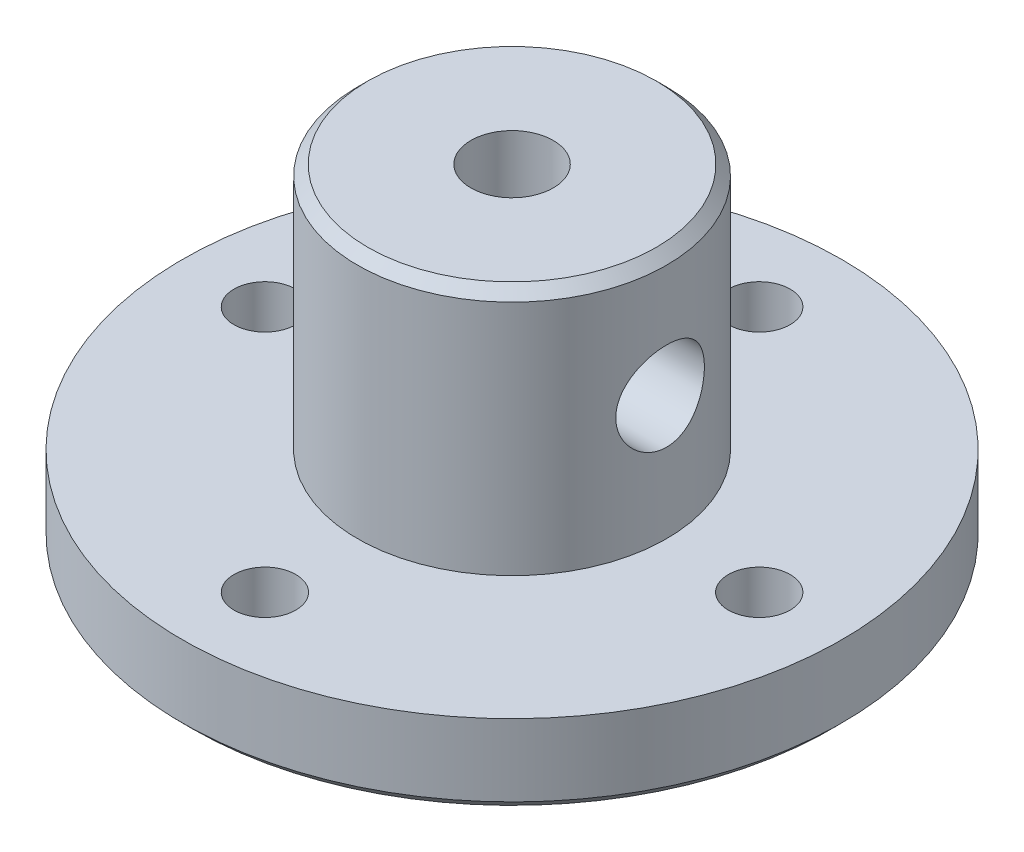
ISO-10303-21;
HEADER;
FILE_DESCRIPTION(('STEP AP214'),'2;1');
FILE_NAME('part.step','',(''),(''),'','','');
FILE_SCHEMA(('AUTOMOTIVE_DESIGN { 1 0 10303 214 1 1 1 1 }'));
ENDSEC;
DATA;
#1=APPLICATION_CONTEXT('core data for automotive mechanical design processes');
#2=APPLICATION_PROTOCOL_DEFINITION('international standard','automotive_design',2000,#1);
#3=PRODUCT_CONTEXT('',#1,'mechanical');
#4=PRODUCT('Part','Part','',(#3));
#5=PRODUCT_RELATED_PRODUCT_CATEGORY('part','',(#4));
#6=PRODUCT_DEFINITION_FORMATION('','',#4);
#7=PRODUCT_DEFINITION_CONTEXT('part definition',#1,'design');
#8=PRODUCT_DEFINITION('design','',#6,#7);
#9=PRODUCT_DEFINITION_SHAPE('','',#8);
#10=(LENGTH_UNIT() NAMED_UNIT(*) SI_UNIT(.MILLI.,.METRE.));
#11=(NAMED_UNIT(*) PLANE_ANGLE_UNIT() SI_UNIT($,.RADIAN.));
#12=(NAMED_UNIT(*) SI_UNIT($,.STERADIAN.) SOLID_ANGLE_UNIT());
#13=UNCERTAINTY_MEASURE_WITH_UNIT(LENGTH_MEASURE(1.E-05),#10,'distance_accuracy_value','');
#14=(GEOMETRIC_REPRESENTATION_CONTEXT(3) GLOBAL_UNCERTAINTY_ASSIGNED_CONTEXT((#13)) GLOBAL_UNIT_ASSIGNED_CONTEXT((#10,
#11,#12)) REPRESENTATION_CONTEXT('',''));
#15=CARTESIAN_POINT('',(0.,0.,0.));
#16=DIRECTION('',(0.,0.,1.));
#17=DIRECTION('',(1.,0.,0.));
#18=AXIS2_PLACEMENT_3D('',#15,#16,#17);
#19=CARTESIAN_POINT('',(0.,22.2286282127256,0.));
#20=DIRECTION('',(0.,1.,0.));
#21=DIRECTION('',(0.,0.,1.));
#22=AXIS2_PLACEMENT_3D('',#19,#20,#21);
#23=PLANE('',#22);
#24=CARTESIAN_POINT('',(0.,22.2286282127256,0.));
#25=DIRECTION('',(0.,1.,0.));
#26=DIRECTION('',(0.,0.,1.));
#27=AXIS2_PLACEMENT_3D('',#24,#25,#26);
#28=CIRCLE('',#27,2.);
#29=CARTESIAN_POINT('',(0.,22.2286282127256,2.));
#30=VERTEX_POINT('',#29);
#31=EDGE_CURVE('E120',#30,#30,#28,.T.);
#32=ORIENTED_EDGE('',*,*,#31,.F.);
#33=EDGE_LOOP('',(#32));
#34=FACE_BOUND('',#33,.T.);
#35=CARTESIAN_POINT('',(0.,22.2286282127256,0.));
#36=DIRECTION('',(0.,-1.,0.));
#37=DIRECTION('',(0.,0.,-1.));
#38=AXIS2_PLACEMENT_3D('',#35,#36,#37);
#39=CIRCLE('',#38,7.);
#40=CARTESIAN_POINT('',(0.,22.2286282127256,-7.));
#41=VERTEX_POINT('',#40);
#42=EDGE_CURVE('E77',#41,#41,#39,.T.);
#43=ORIENTED_EDGE('',*,*,#42,.F.);
#44=EDGE_LOOP('',(#43));
#45=FACE_BOUND('',#44,.T.);
#46=ADVANCED_FACE('F32',(#34,#45),#23,.T.);
#47=CARTESIAN_POINT('',(0.,21.7286282127256,0.));
#48=DIRECTION('',(0.,-1.,0.));
#49=DIRECTION('',(0.,0.,-1.));
#50=AXIS2_PLACEMENT_3D('',#47,#48,#49);
#51=CONICAL_SURFACE('',#50,7.5,0.785398163397448);
#52=ORIENTED_EDGE('',*,*,#42,.T.);
#53=EDGE_LOOP('',(#52));
#54=FACE_BOUND('',#53,.T.);
#55=CARTESIAN_POINT('',(0.,21.7286282127256,0.));
#56=DIRECTION('',(0.,-1.,0.));
#57=DIRECTION('',(0.,0.,-1.));
#58=AXIS2_PLACEMENT_3D('',#55,#56,#57);
#59=CIRCLE('',#58,7.5);
#60=CARTESIAN_POINT('',(0.,21.7286282127256,-7.5));
#61=VERTEX_POINT('',#60);
#62=EDGE_CURVE('E138',#61,#61,#59,.T.);
#63=ORIENTED_EDGE('',*,*,#62,.F.);
#64=EDGE_LOOP('',(#63));
#65=FACE_BOUND('',#64,.T.);
#66=ADVANCED_FACE('F112',(#54,#65),#51,.T.);
#67=CARTESIAN_POINT('',(0.,0.,0.));
#68=DIRECTION('',(0.,-1.,0.));
#69=DIRECTION('',(0.,0.,-1.));
#70=AXIS2_PLACEMENT_3D('',#67,#68,#69);
#71=CYLINDRICAL_SURFACE('',#70,7.5);
#72=CARTESIAN_POINT('',(7.18522790174397,16.2286282127256,-2.15));
#73=CARTESIAN_POINT('',(7.18522952959183,16.3467005145553,-2.14999791278128));
#74=CARTESIAN_POINT('',(7.18817010293663,16.4647938714445,-2.14024056046012));
#75=CARTESIAN_POINT('',(7.19957265736512,16.697545354359,-2.10155838023307));
#76=CARTESIAN_POINT('',(7.20803685767871,16.8122020802737,-2.07262584823439));
#77=CARTESIAN_POINT('',(7.22945098205107,17.0346784327167,-1.99664250384145));
#78=CARTESIAN_POINT('',(7.24239392359912,17.142508394651,-1.949619881837));
#79=CARTESIAN_POINT('',(7.27129797147,17.348771734525,-1.83888214063124));
#80=CARTESIAN_POINT('',(7.28725944230478,17.4472039754508,-1.7751650050731));
#81=CARTESIAN_POINT('',(7.32091920300458,17.634721888412,-1.63087662814557));
#82=CARTESIAN_POINT('',(7.33865199705826,17.7234958184652,-1.54990820537289));
#83=CARTESIAN_POINT('',(7.37356037832633,17.8864091729335,-1.3742680923439));
#84=CARTESIAN_POINT('',(7.39073589969187,17.9605468731164,-1.27959478984826));
#85=CARTESIAN_POINT('',(7.4229836183,18.0934146868685,-1.07703777176159));
#86=CARTESIAN_POINT('',(7.43801039636039,18.1518302176313,-0.968939842931909));
#87=CARTESIAN_POINT('',(7.46386870327287,18.2495358274319,-0.743952246951203));
#88=CARTESIAN_POINT('',(7.47470105453357,18.2888296560836,-0.627064308645577));
#89=CARTESIAN_POINT('',(7.49070592792324,18.3461542012923,-0.391073184646221));
#90=CARTESIAN_POINT('',(7.49601963551321,18.3647162969986,-0.272108822107239));
#91=CARTESIAN_POINT('',(7.50088424095956,18.3817272167193,-0.0326437400395143));
#92=CARTESIAN_POINT('',(7.50043624748667,18.3801799101991,0.0878566794621086));
#93=CARTESIAN_POINT('',(7.49392923934446,18.3573798824655,0.323257585634359));
#94=CARTESIAN_POINT('',(7.48803392143217,18.3367020278833,0.438218980190829));
#95=CARTESIAN_POINT('',(7.47149120712331,18.2771626386443,0.662965804759459));
#96=CARTESIAN_POINT('',(7.46084352074875,18.2382999943888,0.772750918475513));
#97=CARTESIAN_POINT('',(7.43575936625189,18.1430840590023,0.985436796483991));
#98=CARTESIAN_POINT('',(7.4212825716075,18.0865433619294,1.08824871033498));
#99=CARTESIAN_POINT('',(7.39008595087552,17.9577226123679,1.28311429421692));
#100=CARTESIAN_POINT('',(7.3733656308569,17.885439091774,1.37516558683195));
#101=CARTESIAN_POINT('',(7.33878384837899,17.7241734212188,1.54932888111556));
#102=CARTESIAN_POINT('',(7.32090293943718,17.6346916410914,1.63097498084543));
#103=CARTESIAN_POINT('',(7.28653845296415,17.4431265615679,1.77822668112071));
#104=CARTESIAN_POINT('',(7.27005499045911,17.3410422265298,1.84383096207286));
#105=CARTESIAN_POINT('',(7.24026455697807,17.1260335345306,1.95756708499716));
#106=CARTESIAN_POINT('',(7.22698434166858,17.0130282189594,2.00555339409292));
#107=CARTESIAN_POINT('',(7.20542660143551,16.7800746035367,2.08168459866565));
#108=CARTESIAN_POINT('',(7.19714760965565,16.6601283507797,2.10983531231608));
#109=CARTESIAN_POINT('',(7.18684781252248,16.421100549415,2.144653602803));
#110=CARTESIAN_POINT('',(7.18462237338161,16.3021300925999,2.15202396372803));
#111=CARTESIAN_POINT('',(7.18611823027872,16.064652586033,2.14702412882125));
#112=CARTESIAN_POINT('',(7.18983877872691,15.9461454799021,2.13465641466047));
#113=CARTESIAN_POINT('',(7.20260783338868,15.71579606501,2.09115491957001));
#114=CARTESIAN_POINT('',(7.21153131160875,15.6038630431827,2.06046111775361));
#115=CARTESIAN_POINT('',(7.23357427541516,15.3867388871854,1.98168244643606));
#116=CARTESIAN_POINT('',(7.24669436927843,15.2815487330128,1.93359505569518));
#117=CARTESIAN_POINT('',(7.27605859677421,15.078004057855,1.82002289524481));
#118=CARTESIAN_POINT('',(7.29237234029344,14.9798847475521,1.75413501332713));
#119=CARTESIAN_POINT('',(7.32613045636106,14.7958377845068,1.60731943096464));
#120=CARTESIAN_POINT('',(7.3435750750828,14.7099127993435,1.52638844867063));
#121=CARTESIAN_POINT('',(7.37834784915199,14.5496847619699,1.34850172783648));
#122=CARTESIAN_POINT('',(7.39565184277786,14.4758766671238,1.25109441330888));
#123=CARTESIAN_POINT('',(7.42759125711435,14.3456492959685,1.04487248660158));
#124=CARTESIAN_POINT('',(7.44222681696933,14.289229112868,0.936058469685887));
#125=CARTESIAN_POINT('',(7.46708736991064,14.195918363346,0.710863340900806));
#126=CARTESIAN_POINT('',(7.47734562094681,14.1588800313142,0.594547310376428));
#127=CARTESIAN_POINT('',(7.49244262682451,14.1049815670571,0.356998709934216));
#128=CARTESIAN_POINT('',(7.49728278590225,14.0881162064159,0.235767422374526));
#129=CARTESIAN_POINT('',(7.50092061581289,14.0754115811521,-0.00357653114589186));
#130=CARTESIAN_POINT('',(7.49992549360983,14.0788513254198,-0.121648278122092));
#131=CARTESIAN_POINT('',(7.49248478243479,14.1049561550966,-0.355461892768324));
#132=CARTESIAN_POINT('',(7.48603945751709,14.1276203091115,-0.471203873033988));
#133=CARTESIAN_POINT('',(7.4684744994608,14.1910991859595,-0.696063497776017));
#134=CARTESIAN_POINT('',(7.45739770907534,14.2317477419496,-0.805231624632801));
#135=CARTESIAN_POINT('',(7.43171965904609,14.3298937131835,-1.01525842059505));
#136=CARTESIAN_POINT('',(7.41711785143841,14.3873937482871,-1.11611579452127));
#137=CARTESIAN_POINT('',(7.3853922498125,14.5196079917492,-1.30993111605423));
#138=CARTESIAN_POINT('',(7.36820611983216,14.594785354002,-1.40256284919886));
#139=CARTESIAN_POINT('',(7.33346889204965,14.7593680843565,-1.57413865649494));
#140=CARTESIAN_POINT('',(7.31591769431319,14.8487773941094,-1.6530789259928));
#141=CARTESIAN_POINT('',(7.28189482862385,15.0421322372322,-1.79712019136953));
#142=CARTESIAN_POINT('',(7.26546408239614,15.1464001385138,-1.86179911062207));
#143=CARTESIAN_POINT('',(7.23616291956501,15.3647869937987,-1.97262579069247));
#144=CARTESIAN_POINT('',(7.22329052950073,15.4789004412063,-2.01878382961241));
#145=CARTESIAN_POINT('',(7.20405285638923,15.6983291444646,-2.08630908304128));
#146=CARTESIAN_POINT('',(7.19705610112881,15.8028390375437,-2.11013155173257));
#147=CARTESIAN_POINT('',(7.18764325279373,16.014436527077,-2.14197668995079));
#148=CARTESIAN_POINT('',(7.18522642510773,16.1215237073484,-2.15000189333591));
#149=CARTESIAN_POINT('',(7.18522790174397,16.2286282127256,-2.15));
#150=B_SPLINE_CURVE_WITH_KNOTS('',3,(#72,#73,#74,#75,#76,#77,#78,#79,#80,#81,#82,#83,#84,#85,
#86,#87,#88,#89,#90,#91,#92,#93,#94,#95,#96,#97,#98,#99,#100,#101,#102,#103,#104,#105,#106,#107,
#108,#109,#110,#111,#112,#113,#114,#115,#116,#117,#118,#119,#120,#121,#122,#123,#124,#125,#126,
#127,#128,#129,#130,#131,#132,#133,#134,#135,#136,#137,#138,#139,#140,#141,#142,#143,#144,#145,
#146,#147,#148,#149),.UNSPECIFIED.,.T.,.F.,(4,2,2,2,2,2,2,2,2,2,2,2,2,2,2,2,2,2,2,2,2,2,2,2,2,2,
2,2,2,2,2,2,2,2,2,2,2,2,4),(0.,0.353822347415786,0.707786937775859,1.06120215314891,
1.41466007356586,1.77736138251889,2.14010539430869,2.50964340689844,2.87910892678965,
3.23887023530609,3.59856231932507,3.94778502354856,4.29702903940711,4.65010867684082,
5.00326617566948,5.36889745454903,5.7345587999933,6.10317611960638,6.47168527139026,
6.82757281136743,7.183415609078,7.53104058316896,7.87871596648591,8.2350422596189,
8.59144638143129,8.95997808557066,9.32849056727929,9.69415103151202,10.0597167035859,
10.4123818573577,10.7650299260027,11.1144856187066,11.4639956693137,11.8239524100005,
12.1840090175921,12.5536051289085,12.9229958494518,13.2440029514767,13.5649585602361),.UNSPECIFIED.);
#151=CARTESIAN_POINT('',(7.18522790174397,16.2286282127256,-2.15));
#152=VERTEX_POINT('',#151);
#153=EDGE_CURVE('E70',#152,#152,#150,.T.);
#154=ORIENTED_EDGE('',*,*,#153,.F.);
#155=EDGE_LOOP('',(#154));
#156=FACE_BOUND('',#155,.T.);
#157=ORIENTED_EDGE('',*,*,#62,.T.);
#158=EDGE_LOOP('',(#157));
#159=FACE_BOUND('',#158,.T.);
#160=CARTESIAN_POINT('',(0.,10.2286282127256,0.));
#161=DIRECTION('',(0.,-1.,0.));
#162=DIRECTION('',(0.,0.,-1.));
#163=AXIS2_PLACEMENT_3D('',#160,#161,#162);
#164=CIRCLE('',#163,7.5);
#165=CARTESIAN_POINT('',(0.,10.2286282127256,-7.5));
#166=VERTEX_POINT('',#165);
#167=EDGE_CURVE('E136',#166,#166,#164,.T.);
#168=ORIENTED_EDGE('',*,*,#167,.F.);
#169=EDGE_LOOP('',(#168));
#170=FACE_BOUND('',#169,.T.);
#171=ADVANCED_FACE('F107',(#156,#159,#170),#71,.T.);
#172=CARTESIAN_POINT('',(7.5,10.2286282127256,0.));
#173=DIRECTION('',(0.,1.,0.));
#174=DIRECTION('',(0.,0.,1.));
#175=AXIS2_PLACEMENT_3D('',#172,#173,#174);
#176=PLANE('',#175);
#177=CARTESIAN_POINT('',(0.,10.2286282127256,-12.));
#178=DIRECTION('',(0.,1.,0.));
#179=DIRECTION('',(0.,0.,1.));
#180=AXIS2_PLACEMENT_3D('',#177,#178,#179);
#181=CIRCLE('',#180,1.5);
#182=CARTESIAN_POINT('',(0.,10.2286282127256,-10.5));
#183=VERTEX_POINT('',#182);
#184=EDGE_CURVE('E269',#183,#183,#181,.T.);
#185=ORIENTED_EDGE('',*,*,#184,.F.);
#186=EDGE_LOOP('',(#185));
#187=FACE_BOUND('',#186,.T.);
#188=CARTESIAN_POINT('',(12.,10.2286282127256,0.));
#189=DIRECTION('',(0.,1.,0.));
#190=DIRECTION('',(0.,0.,1.));
#191=AXIS2_PLACEMENT_3D('',#188,#189,#190);
#192=CIRCLE('',#191,1.5);
#193=CARTESIAN_POINT('',(12.,10.2286282127256,1.5));
#194=VERTEX_POINT('',#193);
#195=EDGE_CURVE('E270',#194,#194,#192,.T.);
#196=ORIENTED_EDGE('',*,*,#195,.F.);
#197=EDGE_LOOP('',(#196));
#198=FACE_BOUND('',#197,.T.);
#199=CARTESIAN_POINT('',(0.,10.2286282127256,12.));
#200=DIRECTION('',(0.,1.,0.));
#201=DIRECTION('',(0.,0.,1.));
#202=AXIS2_PLACEMENT_3D('',#199,#200,#201);
#203=CIRCLE('',#202,1.5);
#204=CARTESIAN_POINT('',(0.,10.2286282127256,13.5));
#205=VERTEX_POINT('',#204);
#206=EDGE_CURVE('E279',#205,#205,#203,.T.);
#207=ORIENTED_EDGE('',*,*,#206,.F.);
#208=EDGE_LOOP('',(#207));
#209=FACE_BOUND('',#208,.T.);
#210=CARTESIAN_POINT('',(-12.,10.2286282127256,0.));
#211=DIRECTION('',(0.,1.,0.));
#212=DIRECTION('',(0.,0.,1.));
#213=AXIS2_PLACEMENT_3D('',#210,#211,#212);
#214=CIRCLE('',#213,1.5);
#215=CARTESIAN_POINT('',(-12.,10.2286282127256,1.5));
#216=VERTEX_POINT('',#215);
#217=EDGE_CURVE('E285',#216,#216,#214,.T.);
#218=ORIENTED_EDGE('',*,*,#217,.F.);
#219=EDGE_LOOP('',(#218));
#220=FACE_BOUND('',#219,.T.);
#221=ORIENTED_EDGE('',*,*,#167,.T.);
#222=EDGE_LOOP('',(#221));
#223=FACE_BOUND('',#222,.T.);
#224=CARTESIAN_POINT('',(0.,10.2286282127256,0.));
#225=DIRECTION('',(0.,-1.,0.));
#226=DIRECTION('',(0.,0.,-1.));
#227=AXIS2_PLACEMENT_3D('',#224,#225,#226);
#228=CIRCLE('',#227,16.);
#229=CARTESIAN_POINT('',(0.,10.2286282127256,-16.));
#230=VERTEX_POINT('',#229);
#231=EDGE_CURVE('E133',#230,#230,#228,.T.);
#232=ORIENTED_EDGE('',*,*,#231,.F.);
#233=EDGE_LOOP('',(#232));
#234=FACE_BOUND('',#233,.T.);
#235=ADVANCED_FACE('F103',(#187,#198,#209,#220,#223,#234),#176,.T.);
#236=CARTESIAN_POINT('',(0.,0.,0.));
#237=DIRECTION('',(0.,-1.,0.));
#238=DIRECTION('',(0.,0.,-1.));
#239=AXIS2_PLACEMENT_3D('',#236,#237,#238);
#240=CYLINDRICAL_SURFACE('',#239,16.);
#241=ORIENTED_EDGE('',*,*,#231,.T.);
#242=EDGE_LOOP('',(#241));
#243=FACE_BOUND('',#242,.T.);
#244=CARTESIAN_POINT('',(0.,6.72862821272563,0.));
#245=DIRECTION('',(0.,-1.,0.));
#246=DIRECTION('',(0.,0.,-1.));
#247=AXIS2_PLACEMENT_3D('',#244,#245,#246);
#248=CIRCLE('',#247,16.);
#249=CARTESIAN_POINT('',(0.,6.72862821272563,-16.));
#250=VERTEX_POINT('',#249);
#251=EDGE_CURVE('E130',#250,#250,#248,.T.);
#252=ORIENTED_EDGE('',*,*,#251,.F.);
#253=EDGE_LOOP('',(#252));
#254=FACE_BOUND('',#253,.T.);
#255=ADVANCED_FACE('F99',(#243,#254),#240,.T.);
#256=CARTESIAN_POINT('',(0.,6.22862821272563,0.));
#257=DIRECTION('',(0.,1.,0.));
#258=DIRECTION('',(0.,0.,1.));
#259=AXIS2_PLACEMENT_3D('',#256,#257,#258);
#260=CONICAL_SURFACE('',#259,15.5,0.785398163397445);
#261=ORIENTED_EDGE('',*,*,#251,.T.);
#262=EDGE_LOOP('',(#261));
#263=FACE_BOUND('',#262,.T.);
#264=CARTESIAN_POINT('',(0.,6.22862821272563,0.));
#265=DIRECTION('',(0.,-1.,0.));
#266=DIRECTION('',(0.,0.,-1.));
#267=AXIS2_PLACEMENT_3D('',#264,#265,#266);
#268=CIRCLE('',#267,15.5);
#269=CARTESIAN_POINT('',(0.,6.22862821272563,-15.5));
#270=VERTEX_POINT('',#269);
#271=EDGE_CURVE('E125',#270,#270,#268,.T.);
#272=ORIENTED_EDGE('',*,*,#271,.F.);
#273=EDGE_LOOP('',(#272));
#274=FACE_BOUND('',#273,.T.);
#275=ADVANCED_FACE('F95',(#263,#274),#260,.T.);
#276=CARTESIAN_POINT('',(15.5,6.22862821272563,0.));
#277=DIRECTION('',(0.,-1.,0.));
#278=DIRECTION('',(0.,0.,-1.));
#279=AXIS2_PLACEMENT_3D('',#276,#277,#278);
#280=PLANE('',#279);
#281=CARTESIAN_POINT('',(0.,6.22862821272563,-12.));
#282=DIRECTION('',(0.,1.,0.));
#283=DIRECTION('',(0.,0.,1.));
#284=AXIS2_PLACEMENT_3D('',#281,#282,#283);
#285=CIRCLE('',#284,1.5);
#286=CARTESIAN_POINT('',(0.,6.22862821272563,-10.5));
#287=VERTEX_POINT('',#286);
#288=EDGE_CURVE('E266',#287,#287,#285,.T.);
#289=ORIENTED_EDGE('',*,*,#288,.T.);
#290=EDGE_LOOP('',(#289));
#291=FACE_BOUND('',#290,.T.);
#292=CARTESIAN_POINT('',(12.,6.22862821272563,0.));
#293=DIRECTION('',(0.,1.,0.));
#294=DIRECTION('',(0.,0.,1.));
#295=AXIS2_PLACEMENT_3D('',#292,#293,#294);
#296=CIRCLE('',#295,1.5);
#297=CARTESIAN_POINT('',(12.,6.22862821272563,1.5));
#298=VERTEX_POINT('',#297);
#299=EDGE_CURVE('E274',#298,#298,#296,.T.);
#300=ORIENTED_EDGE('',*,*,#299,.T.);
#301=EDGE_LOOP('',(#300));
#302=FACE_BOUND('',#301,.T.);
#303=CARTESIAN_POINT('',(0.,6.22862821272563,12.));
#304=DIRECTION('',(0.,1.,0.));
#305=DIRECTION('',(0.,0.,1.));
#306=AXIS2_PLACEMENT_3D('',#303,#304,#305);
#307=CIRCLE('',#306,1.5);
#308=CARTESIAN_POINT('',(0.,6.22862821272563,13.5));
#309=VERTEX_POINT('',#308);
#310=EDGE_CURVE('E282',#309,#309,#307,.T.);
#311=ORIENTED_EDGE('',*,*,#310,.T.);
#312=EDGE_LOOP('',(#311));
#313=FACE_BOUND('',#312,.T.);
#314=CARTESIAN_POINT('',(-12.,6.22862821272563,0.));
#315=DIRECTION('',(0.,1.,0.));
#316=DIRECTION('',(0.,0.,1.));
#317=AXIS2_PLACEMENT_3D('',#314,#315,#316);
#318=CIRCLE('',#317,1.5);
#319=CARTESIAN_POINT('',(-12.,6.22862821272563,1.5));
#320=VERTEX_POINT('',#319);
#321=EDGE_CURVE('E287',#320,#320,#318,.T.);
#322=ORIENTED_EDGE('',*,*,#321,.T.);
#323=EDGE_LOOP('',(#322));
#324=FACE_BOUND('',#323,.T.);
#325=CARTESIAN_POINT('',(0.,6.22862821272563,0.));
#326=DIRECTION('',(0.,1.,0.));
#327=DIRECTION('',(0.,0.,1.));
#328=AXIS2_PLACEMENT_3D('',#325,#326,#327);
#329=CIRCLE('',#328,2.);
#330=CARTESIAN_POINT('',(0.,6.22862821272563,2.));
#331=VERTEX_POINT('',#330);
#332=EDGE_CURVE('E122',#331,#331,#329,.T.);
#333=ORIENTED_EDGE('',*,*,#332,.T.);
#334=EDGE_LOOP('',(#333));
#335=FACE_BOUND('',#334,.T.);
#336=ORIENTED_EDGE('',*,*,#271,.T.);
#337=EDGE_LOOP('',(#336));
#338=FACE_BOUND('',#337,.T.);
#339=ADVANCED_FACE('F89',(#291,#302,#313,#324,#335,#338),#280,.T.);
#340=CARTESIAN_POINT('',(0.,6.22862821272563,0.));
#341=DIRECTION('',(0.,1.,0.));
#342=DIRECTION('',(0.,0.,1.));
#343=AXIS2_PLACEMENT_3D('',#340,#341,#342);
#344=CYLINDRICAL_SURFACE('',#343,2.);
#345=DIRECTION('',(0.,1.,0.));
#346=VECTOR('',#345,1.);
#347=CARTESIAN_POINT('',(0.,6.22862821272563,-2.));
#348=LINE('',#347,#346);
#349=CARTESIAN_POINT('',(0.,15.4396415208227,-2.));
#350=VERTEX_POINT('',#349);
#351=CARTESIAN_POINT('',(-1.8474805019153E-13,17.0176149046286,-2.));
#352=VERTEX_POINT('',#351);
#353=EDGE_CURVE('E67',#350,#352,#348,.T.);
#354=ORIENTED_EDGE('',*,*,#353,.T.);
#355=CARTESIAN_POINT('',(0.,17.0176149046286,-2.));
#356=CARTESIAN_POINT('',(0.0273844085615572,17.0175855398589,-2.00000587733176));
#357=CARTESIAN_POINT('',(0.0547384046705307,17.0190419370307,-1.99943741063917));
#358=CARTESIAN_POINT('',(0.109030152004812,17.024663370716,-1.99720867164096));
#359=CARTESIAN_POINT('',(0.135969013501376,17.0288190473911,-1.99555217190311));
#360=CARTESIAN_POINT('',(0.214802598947177,17.0447347236194,-1.98912014653098));
#361=CARTESIAN_POINT('',(0.265876504731533,17.0599656665418,-1.98287688028839));
#362=CARTESIAN_POINT('',(0.392329738173156,17.1068332040088,-1.9626980097307));
#363=CARTESIAN_POINT('',(0.46558699923007,17.1428850842001,-1.9464191795755));
#364=CARTESIAN_POINT('',(0.606997055537668,17.2223642043662,-1.90709405910283));
#365=CARTESIAN_POINT('',(0.675069964722995,17.2658822825156,-1.88396150646294));
#366=CARTESIAN_POINT('',(0.80359836837634,17.3538849205391,-1.83269720736004));
#367=CARTESIAN_POINT('',(0.864260134546186,17.3982332563457,-1.80484391561301));
#368=CARTESIAN_POINT('',(0.982073172141564,17.4877978988342,-1.74354350990303));
#369=CARTESIAN_POINT('',(1.0392218027384,17.5330148257228,-1.71009225658259));
#370=CARTESIAN_POINT('',(1.1499387123574,17.6228382156089,-1.63767959149405));
#371=CARTESIAN_POINT('',(1.20352100806636,17.6674464439836,-1.59874188877364));
#372=CARTESIAN_POINT('',(1.30723488550179,17.7552602269681,-1.51511501940283));
#373=CARTESIAN_POINT('',(1.3573663589849,17.7984657375559,-1.47042567246431));
#374=CARTESIAN_POINT('',(1.47697201214311,17.9027607786942,-1.35226556119355));
#375=CARTESIAN_POINT('',(1.54420822680304,17.9625028968569,-1.27526250952679));
#376=CARTESIAN_POINT('',(1.66823788789278,18.0738330212723,-1.10805241683449));
#377=CARTESIAN_POINT('',(1.72504434612519,18.1254311762101,-1.01786208378097));
#378=CARTESIAN_POINT('',(1.81490195874911,18.2075446872069,-0.84473872514298));
#379=CARTESIAN_POINT('',(1.85043595901697,18.240213527611,-0.764129248519861));
#380=CARTESIAN_POINT('',(1.91120482420609,18.2962513238306,-0.596039359248764));
#381=CARTESIAN_POINT('',(1.93644659537525,18.3196265155676,-0.508563601140154));
#382=CARTESIAN_POINT('',(1.97506667104316,18.355441667934,-0.328134814443503));
#383=CARTESIAN_POINT('',(1.98836031287726,18.3678035848163,-0.235147598552556));
#384=CARTESIAN_POINT('',(2.00164670054222,18.3801586063533,-0.047419293288829));
#385=CARTESIAN_POINT('',(2.00164611087527,18.3801579084835,0.0473208934849099));
#386=CARTESIAN_POINT('',(1.98913085859644,18.3685202487054,0.224354937124833));
#387=CARTESIAN_POINT('',(1.97803190263255,18.3581996895688,0.306844337690087));
#388=CARTESIAN_POINT('',(1.94615433976505,18.3286238136334,0.468244261017134));
#389=CARTESIAN_POINT('',(1.92537445571409,18.3093673179707,0.547154310068622));
#390=CARTESIAN_POINT('',(1.87439516725991,18.2622844487737,0.7025495458114));
#391=CARTESIAN_POINT('',(1.8438817817526,18.2341728759257,0.778843313917316));
#392=CARTESIAN_POINT('',(1.7751574646235,18.1711774020659,0.924845315763141));
#393=CARTESIAN_POINT('',(1.73694205173297,18.136289558849,0.99454968074628));
#394=CARTESIAN_POINT('',(1.63242572645347,18.0415240694925,1.16161206603883));
#395=CARTESIAN_POINT('',(1.5618958841303,17.9781261362669,1.25434106183625));
#396=CARTESIAN_POINT('',(1.40953273713361,17.8435601151541,1.42345881301736));
#397=CARTESIAN_POINT('',(1.32767429094505,17.772374820554,1.49981023307227));
#398=CARTESIAN_POINT('',(1.15255045404488,17.6245260469244,1.63842071932248));
#399=CARTESIAN_POINT('',(1.05905733639507,17.5477717890931,1.70029494697712));
#400=CARTESIAN_POINT('',(0.911468627676958,17.4337543267897,1.78111206651714));
#401=CARTESIAN_POINT('',(0.861012196332747,17.3959098104853,1.80606443780502));
#402=CARTESIAN_POINT('',(0.757311924351813,17.3216503509931,1.8519441780583));
#403=CARTESIAN_POINT('',(0.704069970612554,17.2852344685816,1.87287422793703));
#404=CARTESIAN_POINT('',(0.596956389819486,17.2171784900534,1.9096300774691));
#405=CARTESIAN_POINT('',(0.543250672936867,17.1853903948473,1.92565943058698));
#406=CARTESIAN_POINT('',(0.432449371141941,17.1271262841066,1.95351697313848));
#407=CARTESIAN_POINT('',(0.375384219634862,17.1006099451619,1.96537763203531));
#408=CARTESIAN_POINT('',(0.266428681707984,17.0601234887711,1.98280888148682));
#409=CARTESIAN_POINT('',(0.215181677702148,17.0448215710112,1.98908423290061));
#410=CARTESIAN_POINT('',(0.136136393534274,17.0288476126682,1.99554104328926));
#411=CARTESIAN_POINT('',(0.109163557646847,17.0246810743341,1.99720177385445));
#412=CARTESIAN_POINT('',(0.0548050839656649,17.0190448994359,1.99943610471867));
#413=CARTESIAN_POINT('',(0.0274183617444752,17.0175843941835,2.00000602436849));
#414=CARTESIAN_POINT('',(-1.82643841265948E-13,17.0176149046291,2.00000000000004));
#415=B_SPLINE_CURVE_WITH_KNOTS('',3,(#355,#356,#357,#358,#359,#360,#361,#362,#363,#364,#365,
#366,#367,#368,#369,#370,#371,#372,#373,#374,#375,#376,#377,#378,#379,#380,#381,#382,#383,#384,
#385,#386,#387,#388,#389,#390,#391,#392,#393,#394,#395,#396,#397,#398,#399,#400,#401,#402,#403,
#404,#405,#406,#407,#408,#409,#410,#411,#412,#413,#414),.UNSPECIFIED.,.F.,.F.,(4,2,2,2,2,2,2,2,
2,2,2,2,2,2,2,2,2,2,2,2,2,2,2,2,2,2,2,2,2,4),(0.,0.0820581237829252,0.163833216520261,
0.323964234906139,0.572368815528667,0.82404325493108,1.0641567992981,1.30444868419848,
1.54373232650217,1.78302347109739,2.13694263082484,2.49041720769092,2.77117970098653,
3.05175348695236,3.3343000516077,3.61670497346433,3.86716183206017,4.11765174130247,
4.37721651461086,4.6369327486916,5.03262804888716,5.42921603293058,5.83538113340892,
6.03872945009757,6.24194175964696,6.43494843447416,6.6264166314791,6.78709715563077,
6.8689787776908,6.95113620360117),.UNSPECIFIED.);
#416=CARTESIAN_POINT('',(0.,17.0176149046286,2.));
#417=VERTEX_POINT('',#416);
#418=EDGE_CURVE('E11',#352,#417,#415,.T.);
#419=ORIENTED_EDGE('',*,*,#418,.T.);
#420=DIRECTION('',(0.,1.,0.));
#421=VECTOR('',#420,1.);
#422=CARTESIAN_POINT('',(0.,6.22862821272563,2.));
#423=LINE('',#422,#421);
#424=CARTESIAN_POINT('',(-1.8474805019153E-13,15.4396415208227,2.));
#425=VERTEX_POINT('',#424);
#426=EDGE_CURVE('E45',#417,#425,#423,.F.);
#427=ORIENTED_EDGE('',*,*,#426,.T.);
#428=CARTESIAN_POINT('',(0.,15.4396415208227,2.));
#429=CARTESIAN_POINT('',(0.0273844085615571,15.4396708855923,2.00000587733176));
#430=CARTESIAN_POINT('',(0.0547384046705305,15.4382144884206,1.99943741063917));
#431=CARTESIAN_POINT('',(0.109030152004812,15.4325930547352,1.99720867164096));
#432=CARTESIAN_POINT('',(0.135969013501376,15.4284373780601,1.99555217190311));
#433=CARTESIAN_POINT('',(0.214802598947177,15.4125217018319,1.98912014653098));
#434=CARTESIAN_POINT('',(0.265876504731533,15.3972907589094,1.98287688028839));
#435=CARTESIAN_POINT('',(0.392329738173156,15.3504232214424,1.9626980097307));
#436=CARTESIAN_POINT('',(0.46558699923007,15.3143713412512,1.9464191795755));
#437=CARTESIAN_POINT('',(0.606997055537667,15.2348922210851,1.90709405910283));
#438=CARTESIAN_POINT('',(0.675069964722994,15.1913741429357,1.88396150646294));
#439=CARTESIAN_POINT('',(0.80359836837634,15.1033715049122,1.83269720736004));
#440=CARTESIAN_POINT('',(0.864260134546186,15.0590231691055,1.80484391561301));
#441=CARTESIAN_POINT('',(0.982073172141563,14.969458526617,1.74354350990304));
#442=CARTESIAN_POINT('',(1.0392218027384,14.9242415997285,1.71009225658259));
#443=CARTESIAN_POINT('',(1.1499387123574,14.8344182098424,1.63767959149406));
#444=CARTESIAN_POINT('',(1.20352100806636,14.7898099814677,1.59874188877364));
#445=CARTESIAN_POINT('',(1.30723488550179,14.7019961984832,1.51511501940283));
#446=CARTESIAN_POINT('',(1.3573663589849,14.6587906878954,1.47042567246431));
#447=CARTESIAN_POINT('',(1.47697201214311,14.554495646757,1.35226556119355));
#448=CARTESIAN_POINT('',(1.54420822680304,14.4947535285944,1.27526250952679));
#449=CARTESIAN_POINT('',(1.66823788789278,14.383423404179,1.10805241683449));
#450=CARTESIAN_POINT('',(1.72504434612519,14.3318252492412,1.01786208378097));
#451=CARTESIAN_POINT('',(1.81490195874911,14.2497117382443,0.844738725142979));
#452=CARTESIAN_POINT('',(1.85043595901697,14.2170428978403,0.76412924851986));
#453=CARTESIAN_POINT('',(1.91120482420609,14.1610051016207,0.596039359248765));
#454=CARTESIAN_POINT('',(1.93644659537525,14.1376299098836,0.508563601140154));
#455=CARTESIAN_POINT('',(1.97506667104316,14.1018147575173,0.328134814443503));
#456=CARTESIAN_POINT('',(1.98836031287726,14.089452840635,0.235147598552557));
#457=CARTESIAN_POINT('',(2.00164670054222,14.0770978190979,0.04741929328883));
#458=CARTESIAN_POINT('',(2.00164611087526,14.0770985169677,-0.0473208934849089));
#459=CARTESIAN_POINT('',(1.98913085859644,14.0887361767458,-0.224354937124832));
#460=CARTESIAN_POINT('',(1.97803190263255,14.0990567358824,-0.306844337690085));
#461=CARTESIAN_POINT('',(1.94615433976505,14.1286326118179,-0.468244261017133));
#462=CARTESIAN_POINT('',(1.92537445571409,14.1478891074805,-0.547154310068621));
#463=CARTESIAN_POINT('',(1.87439516725991,14.1949719766776,-0.702549545811398));
#464=CARTESIAN_POINT('',(1.8438817817526,14.2230835495255,-0.778843313917315));
#465=CARTESIAN_POINT('',(1.7751574646235,14.2860790233854,-0.92484531576314));
#466=CARTESIAN_POINT('',(1.73694205173297,14.3209668666023,-0.994549680746279));
#467=CARTESIAN_POINT('',(1.63242572645347,14.4157323559587,-1.16161206603883));
#468=CARTESIAN_POINT('',(1.5618958841303,14.4791302891844,-1.25434106183625));
#469=CARTESIAN_POINT('',(1.40953273713361,14.6136963102971,-1.42345881301736));
#470=CARTESIAN_POINT('',(1.32767429094505,14.6848816048973,-1.49981023307227));
#471=CARTESIAN_POINT('',(1.15255045404488,14.8327303785268,-1.63842071932248));
#472=CARTESIAN_POINT('',(1.05905733639507,14.9094846363582,-1.70029494697712));
#473=CARTESIAN_POINT('',(0.911468627676958,15.0235020986615,-1.78111206651714));
#474=CARTESIAN_POINT('',(0.861012196332746,15.0613466149659,-1.80606443780502));
#475=CARTESIAN_POINT('',(0.757311924351812,15.1356060744582,-1.8519441780583));
#476=CARTESIAN_POINT('',(0.704069970612553,15.1720219568696,-1.87287422793703));
#477=CARTESIAN_POINT('',(0.596956389819485,15.2400779353978,-1.9096300774691));
#478=CARTESIAN_POINT('',(0.543250672936865,15.2718660306039,-1.92565943058698));
#479=CARTESIAN_POINT('',(0.432449371141939,15.3301301413446,-1.95351697313849));
#480=CARTESIAN_POINT('',(0.375384219634859,15.3566464802893,-1.96537763203531));
#481=CARTESIAN_POINT('',(0.266428681707982,15.3971329366802,-1.98280888148682));
#482=CARTESIAN_POINT('',(0.215181677702147,15.4124348544401,-1.98908423290061));
#483=CARTESIAN_POINT('',(0.136136393534271,15.428408812783,-1.99554104328927));
#484=CARTESIAN_POINT('',(0.109163557646844,15.4325753511172,-1.99720177385445));
#485=CARTESIAN_POINT('',(0.0548050839656617,15.4382115260153,-1.99943610471867));
#486=CARTESIAN_POINT('',(0.0274183617444722,15.4396720312678,-2.00000602436849));
#487=CARTESIAN_POINT('',(-1.84987274598692E-13,15.4396415208221,-2.00000000000004));
#488=B_SPLINE_CURVE_WITH_KNOTS('',3,(#428,#429,#430,#431,#432,#433,#434,#435,#436,#437,#438,
#439,#440,#441,#442,#443,#444,#445,#446,#447,#448,#449,#450,#451,#452,#453,#454,#455,#456,#457,
#458,#459,#460,#461,#462,#463,#464,#465,#466,#467,#468,#469,#470,#471,#472,#473,#474,#475,#476,
#477,#478,#479,#480,#481,#482,#483,#484,#485,#486,#487),.UNSPECIFIED.,.F.,.F.,(4,2,2,2,2,2,2,2,
2,2,2,2,2,2,2,2,2,2,2,2,2,2,2,2,2,2,2,2,2,4),(0.,0.0820581237829251,0.163833216520261,
0.323964234906139,0.572368815528666,0.824043254931078,1.0641567992981,1.30444868419848,
1.54373232650217,1.78302347109739,2.13694263082484,2.49041720769092,2.77117970098653,
3.05175348695236,3.3343000516077,3.61670497346433,3.86716183206017,4.11765174130247,
4.37721651461086,4.6369327486916,5.03262804888716,5.42921603293057,5.83538113340892,
6.03872945009757,6.24194175964696,6.43494843447416,6.6264166314791,6.78709715563077,
6.8689787776908,6.95113620360118),.UNSPECIFIED.);
#489=EDGE_CURVE('E69',#425,#350,#488,.T.);
#490=ORIENTED_EDGE('',*,*,#489,.T.);
#491=EDGE_LOOP('',(#354,#419,#427,#490));
#492=FACE_BOUND('',#491,.T.);
#493=ORIENTED_EDGE('',*,*,#332,.F.);
#494=EDGE_LOOP('',(#493));
#495=FACE_BOUND('',#494,.T.);
#496=ORIENTED_EDGE('',*,*,#31,.T.);
#497=EDGE_LOOP('',(#496));
#498=FACE_BOUND('',#497,.T.);
#499=ADVANCED_FACE('F73',(#492,#495,#498),#344,.F.);
#500=CARTESIAN_POINT('',(0.,16.2286282127256,0.));
#501=DIRECTION('',(-1.,0.,0.));
#502=DIRECTION('',(0.,0.,1.));
#503=AXIS2_PLACEMENT_3D('',#500,#501,#502);
#504=PLANE('',#503);
#505=CARTESIAN_POINT('',(0.,16.2286282127256,0.));
#506=DIRECTION('',(1.,0.,0.));
#507=DIRECTION('',(0.,0.,-1.));
#508=AXIS2_PLACEMENT_3D('',#505,#506,#507);
#509=CIRCLE('',#508,2.15);
#510=EDGE_CURVE('E64',#417,#425,#509,.T.);
#511=ORIENTED_EDGE('',*,*,#510,.T.);
#512=ORIENTED_EDGE('',*,*,#426,.F.);
#513=EDGE_LOOP('',(#511,#512));
#514=FACE_BOUND('',#513,.T.);
#515=ADVANCED_FACE('F63',(#514),#504,.F.);
#516=EDGE_CURVE('E52',#350,#352,#509,.T.);
#517=ORIENTED_EDGE('',*,*,#516,.T.);
#518=ORIENTED_EDGE('',*,*,#353,.F.);
#519=EDGE_LOOP('',(#517,#518));
#520=FACE_BOUND('',#519,.T.);
#521=ADVANCED_FACE('F188',(#520),#504,.F.);
#522=CARTESIAN_POINT('',(7.5,16.2286282127256,0.));
#523=DIRECTION('',(1.,0.,0.));
#524=DIRECTION('',(0.,0.,-1.));
#525=AXIS2_PLACEMENT_3D('',#522,#523,#524);
#526=CYLINDRICAL_SURFACE('',#525,2.15);
#527=ORIENTED_EDGE('',*,*,#153,.T.);
#528=EDGE_LOOP('',(#527));
#529=FACE_BOUND('',#528,.T.);
#530=ORIENTED_EDGE('',*,*,#516,.F.);
#531=ORIENTED_EDGE('',*,*,#489,.F.);
#532=ORIENTED_EDGE('',*,*,#510,.F.);
#533=ORIENTED_EDGE('',*,*,#418,.F.);
#534=EDGE_LOOP('',(#530,#531,#532,#533));
#535=FACE_BOUND('',#534,.T.);
#536=ADVANCED_FACE('F68',(#529,#535),#526,.F.);
#537=CARTESIAN_POINT('',(-12.,6.22862821272563,0.));
#538=DIRECTION('',(0.,1.,0.));
#539=DIRECTION('',(0.,0.,1.));
#540=AXIS2_PLACEMENT_3D('',#537,#538,#539);
#541=CYLINDRICAL_SURFACE('',#540,1.5);
#542=ORIENTED_EDGE('',*,*,#321,.F.);
#543=EDGE_LOOP('',(#542));
#544=FACE_BOUND('',#543,.T.);
#545=ORIENTED_EDGE('',*,*,#217,.T.);
#546=EDGE_LOOP('',(#545));
#547=FACE_BOUND('',#546,.T.);
#548=ADVANCED_FACE('F198',(#544,#547),#541,.F.);
#549=CARTESIAN_POINT('',(0.,6.22862821272563,12.));
#550=DIRECTION('',(0.,1.,0.));
#551=DIRECTION('',(0.,0.,1.));
#552=AXIS2_PLACEMENT_3D('',#549,#550,#551);
#553=CYLINDRICAL_SURFACE('',#552,1.5);
#554=ORIENTED_EDGE('',*,*,#310,.F.);
#555=EDGE_LOOP('',(#554));
#556=FACE_BOUND('',#555,.T.);
#557=ORIENTED_EDGE('',*,*,#206,.T.);
#558=EDGE_LOOP('',(#557));
#559=FACE_BOUND('',#558,.T.);
#560=ADVANCED_FACE('F204',(#556,#559),#553,.F.);
#561=CARTESIAN_POINT('',(12.,6.22862821272563,0.));
#562=DIRECTION('',(0.,1.,0.));
#563=DIRECTION('',(0.,0.,1.));
#564=AXIS2_PLACEMENT_3D('',#561,#562,#563);
#565=CYLINDRICAL_SURFACE('',#564,1.5);
#566=ORIENTED_EDGE('',*,*,#299,.F.);
#567=EDGE_LOOP('',(#566));
#568=FACE_BOUND('',#567,.T.);
#569=ORIENTED_EDGE('',*,*,#195,.T.);
#570=EDGE_LOOP('',(#569));
#571=FACE_BOUND('',#570,.T.);
#572=ADVANCED_FACE('F212',(#568,#571),#565,.F.);
#573=CARTESIAN_POINT('',(0.,6.22862821272563,-12.));
#574=DIRECTION('',(0.,1.,0.));
#575=DIRECTION('',(0.,0.,1.));
#576=AXIS2_PLACEMENT_3D('',#573,#574,#575);
#577=CYLINDRICAL_SURFACE('',#576,1.5);
#578=ORIENTED_EDGE('',*,*,#288,.F.);
#579=EDGE_LOOP('',(#578));
#580=FACE_BOUND('',#579,.T.);
#581=ORIENTED_EDGE('',*,*,#184,.T.);
#582=EDGE_LOOP('',(#581));
#583=FACE_BOUND('',#582,.T.);
#584=ADVANCED_FACE('F220',(#580,#583),#577,.F.);
#585=CLOSED_SHELL('',(#46,#66,#171,#235,#255,#275,#339,#499,#515,#521,#536,#548,#560,#572,#584));
#586=MANIFOLD_SOLID_BREP('B2',#585);
#587=ADVANCED_BREP_SHAPE_REPRESENTATION('',(#18,#586),#14);
#588=SHAPE_DEFINITION_REPRESENTATION(#9,#587);
ENDSEC;
END-ISO-10303-21;
